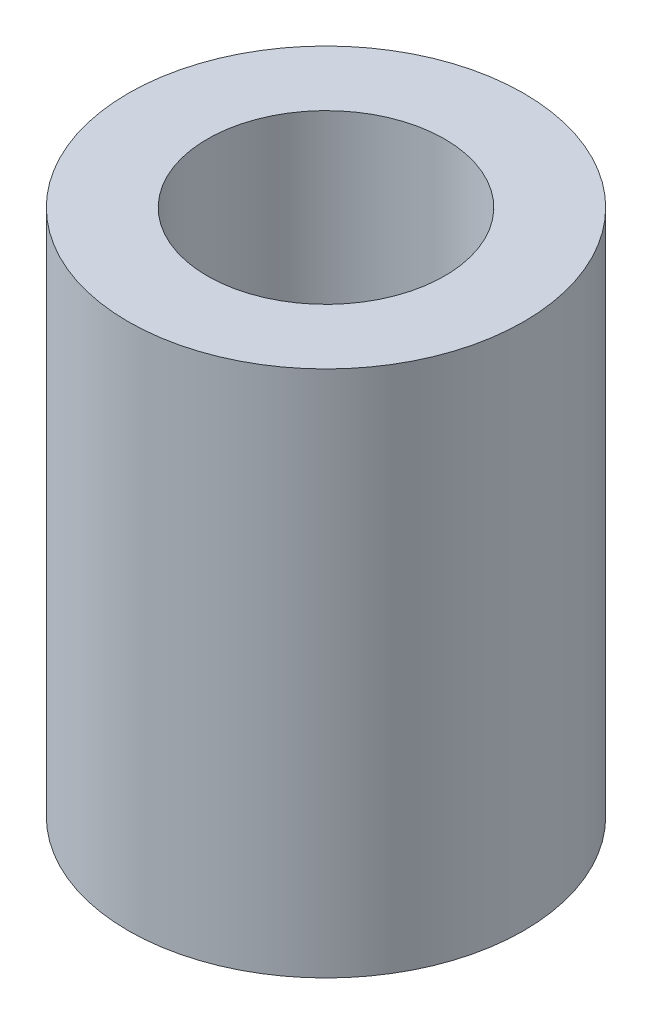
ISO-10303-21;
HEADER;
FILE_DESCRIPTION(('STEP AP214'),'2;1');
FILE_NAME('part.step','',(''),(''),'','','');
FILE_SCHEMA(('AUTOMOTIVE_DESIGN { 1 0 10303 214 1 1 1 1 }'));
ENDSEC;
DATA;
#1=APPLICATION_CONTEXT('core data for automotive mechanical design processes');
#2=APPLICATION_PROTOCOL_DEFINITION('international standard','automotive_design',2000,#1);
#3=PRODUCT_CONTEXT('',#1,'mechanical');
#4=PRODUCT('Part','Part','',(#3));
#5=PRODUCT_RELATED_PRODUCT_CATEGORY('part','',(#4));
#6=PRODUCT_DEFINITION_FORMATION('','',#4);
#7=PRODUCT_DEFINITION_CONTEXT('part definition',#1,'design');
#8=PRODUCT_DEFINITION('design','',#6,#7);
#9=PRODUCT_DEFINITION_SHAPE('','',#8);
#10=(LENGTH_UNIT() NAMED_UNIT(*) SI_UNIT(.MILLI.,.METRE.));
#11=(NAMED_UNIT(*) PLANE_ANGLE_UNIT() SI_UNIT($,.RADIAN.));
#12=(NAMED_UNIT(*) SI_UNIT($,.STERADIAN.) SOLID_ANGLE_UNIT());
#13=UNCERTAINTY_MEASURE_WITH_UNIT(LENGTH_MEASURE(1.E-05),#10,'distance_accuracy_value','');
#14=(GEOMETRIC_REPRESENTATION_CONTEXT(3) GLOBAL_UNCERTAINTY_ASSIGNED_CONTEXT((#13)) GLOBAL_UNIT_ASSIGNED_CONTEXT((#10,
#11,#12)) REPRESENTATION_CONTEXT('',''));
#15=CARTESIAN_POINT('',(0.,0.,0.));
#16=DIRECTION('',(0.,0.,1.));
#17=DIRECTION('',(1.,0.,0.));
#18=AXIS2_PLACEMENT_3D('',#15,#16,#17);
#19=CARTESIAN_POINT('',(0.,6.,0.));
#20=DIRECTION('',(0.,1.,0.));
#21=DIRECTION('',(0.,0.,1.));
#22=AXIS2_PLACEMENT_3D('',#19,#20,#21);
#23=PLANE('',#22);
#24=CARTESIAN_POINT('',(0.,6.,0.));
#25=DIRECTION('',(0.,1.,0.));
#26=DIRECTION('',(0.,0.,1.));
#27=AXIS2_PLACEMENT_3D('',#24,#25,#26);
#28=CIRCLE('',#27,2.25);
#29=CARTESIAN_POINT('',(0.,6.,2.25));
#30=VERTEX_POINT('',#29);
#31=EDGE_CURVE('E10',#30,#30,#28,.T.);
#32=ORIENTED_EDGE('',*,*,#31,.T.);
#33=EDGE_LOOP('',(#32));
#34=FACE_BOUND('',#33,.T.);
#35=CARTESIAN_POINT('',(0.,6.,0.));
#36=DIRECTION('',(0.,1.,0.));
#37=DIRECTION('',(0.,0.,1.));
#38=AXIS2_PLACEMENT_3D('',#35,#36,#37);
#39=CIRCLE('',#38,1.35);
#40=CARTESIAN_POINT('',(0.,6.,1.35));
#41=VERTEX_POINT('',#40);
#42=EDGE_CURVE('E42',#41,#41,#39,.T.);
#43=ORIENTED_EDGE('',*,*,#42,.F.);
#44=EDGE_LOOP('',(#43));
#45=FACE_BOUND('',#44,.T.);
#46=ADVANCED_FACE('F31',(#34,#45),#23,.T.);
#47=CARTESIAN_POINT('',(0.,0.,0.));
#48=DIRECTION('',(0.,1.,0.));
#49=DIRECTION('',(0.,0.,1.));
#50=AXIS2_PLACEMENT_3D('',#47,#48,#49);
#51=PLANE('',#50);
#52=CARTESIAN_POINT('',(0.,0.,0.));
#53=DIRECTION('',(0.,1.,0.));
#54=DIRECTION('',(0.,0.,1.));
#55=AXIS2_PLACEMENT_3D('',#52,#53,#54);
#56=CIRCLE('',#55,2.25);
#57=CARTESIAN_POINT('',(0.,0.,2.25));
#58=VERTEX_POINT('',#57);
#59=EDGE_CURVE('E35',#58,#58,#56,.T.);
#60=ORIENTED_EDGE('',*,*,#59,.F.);
#61=EDGE_LOOP('',(#60));
#62=FACE_BOUND('',#61,.T.);
#63=CARTESIAN_POINT('',(0.,0.,0.));
#64=DIRECTION('',(0.,1.,0.));
#65=DIRECTION('',(0.,0.,1.));
#66=AXIS2_PLACEMENT_3D('',#63,#64,#65);
#67=CIRCLE('',#66,1.35);
#68=CARTESIAN_POINT('',(0.,0.,1.35));
#69=VERTEX_POINT('',#68);
#70=EDGE_CURVE('E44',#69,#69,#67,.T.);
#71=ORIENTED_EDGE('',*,*,#70,.T.);
#72=EDGE_LOOP('',(#71));
#73=FACE_BOUND('',#72,.T.);
#74=ADVANCED_FACE('F54',(#62,#73),#51,.F.);
#75=CARTESIAN_POINT('',(0.,6.,0.));
#76=DIRECTION('',(0.,-1.,0.));
#77=DIRECTION('',(0.,0.,-1.));
#78=AXIS2_PLACEMENT_3D('',#75,#76,#77);
#79=CYLINDRICAL_SURFACE('',#78,2.25);
#80=ORIENTED_EDGE('',*,*,#31,.F.);
#81=EDGE_LOOP('',(#80));
#82=FACE_BOUND('',#81,.T.);
#83=ORIENTED_EDGE('',*,*,#59,.T.);
#84=EDGE_LOOP('',(#83));
#85=FACE_BOUND('',#84,.T.);
#86=ADVANCED_FACE('F33',(#82,#85),#79,.T.);
#87=CARTESIAN_POINT('',(0.,6.,0.));
#88=DIRECTION('',(0.,-1.,0.));
#89=DIRECTION('',(0.,0.,-1.));
#90=AXIS2_PLACEMENT_3D('',#87,#88,#89);
#91=CYLINDRICAL_SURFACE('',#90,1.35);
#92=ORIENTED_EDGE('',*,*,#42,.T.);
#93=EDGE_LOOP('',(#92));
#94=FACE_BOUND('',#93,.T.);
#95=ORIENTED_EDGE('',*,*,#70,.F.);
#96=EDGE_LOOP('',(#95));
#97=FACE_BOUND('',#96,.T.);
#98=ADVANCED_FACE('F50',(#94,#97),#91,.F.);
#99=CLOSED_SHELL('',(#46,#74,#86,#98));
#100=MANIFOLD_SOLID_BREP('B2',#99);
#101=ADVANCED_BREP_SHAPE_REPRESENTATION('',(#18,#100),#14);
#102=SHAPE_DEFINITION_REPRESENTATION(#9,#101);
ENDSEC;
END-ISO-10303-21;
